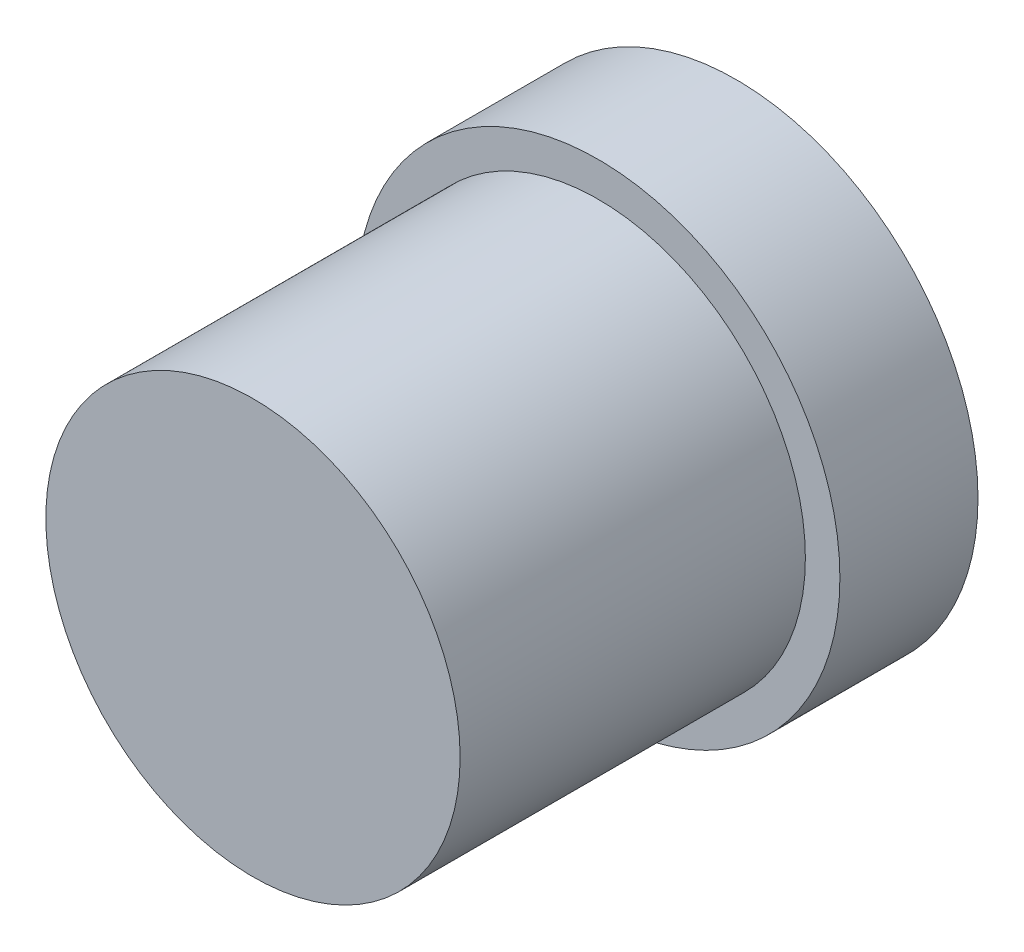
ISO-10303-21;
HEADER;
FILE_DESCRIPTION(('STEP AP214'),'2;1');
FILE_NAME('part.step','',(''),(''),'','','');
FILE_SCHEMA(('AUTOMOTIVE_DESIGN { 1 0 10303 214 1 1 1 1 }'));
ENDSEC;
DATA;
#1=APPLICATION_CONTEXT('core data for automotive mechanical design processes');
#2=APPLICATION_PROTOCOL_DEFINITION('international standard','automotive_design',2000,#1);
#3=PRODUCT_CONTEXT('',#1,'mechanical');
#4=PRODUCT('Part','Part','',(#3));
#5=PRODUCT_RELATED_PRODUCT_CATEGORY('part','',(#4));
#6=PRODUCT_DEFINITION_FORMATION('','',#4);
#7=PRODUCT_DEFINITION_CONTEXT('part definition',#1,'design');
#8=PRODUCT_DEFINITION('design','',#6,#7);
#9=PRODUCT_DEFINITION_SHAPE('','',#8);
#10=(LENGTH_UNIT() NAMED_UNIT(*) SI_UNIT(.MILLI.,.METRE.));
#11=(NAMED_UNIT(*) PLANE_ANGLE_UNIT() SI_UNIT($,.RADIAN.));
#12=(NAMED_UNIT(*) SI_UNIT($,.STERADIAN.) SOLID_ANGLE_UNIT());
#13=UNCERTAINTY_MEASURE_WITH_UNIT(LENGTH_MEASURE(1.E-05),#10,'distance_accuracy_value','');
#14=(GEOMETRIC_REPRESENTATION_CONTEXT(3) GLOBAL_UNCERTAINTY_ASSIGNED_CONTEXT((#13)) GLOBAL_UNIT_ASSIGNED_CONTEXT((#10,
#11,#12)) REPRESENTATION_CONTEXT('',''));
#15=CARTESIAN_POINT('',(0.,0.,0.));
#16=DIRECTION('',(0.,0.,1.));
#17=DIRECTION('',(1.,0.,0.));
#18=AXIS2_PLACEMENT_3D('',#15,#16,#17);
#19=CARTESIAN_POINT('',(0.,0.,4.));
#20=DIRECTION('',(0.,0.,-1.));
#21=DIRECTION('',(-1.,0.,0.));
#22=AXIS2_PLACEMENT_3D('',#19,#20,#21);
#23=CYLINDRICAL_SURFACE('',#22,7.);
#24=CARTESIAN_POINT('',(0.,0.,4.));
#25=DIRECTION('',(0.,0.,1.));
#26=DIRECTION('',(1.,0.,0.));
#27=AXIS2_PLACEMENT_3D('',#24,#25,#26);
#28=CIRCLE('',#27,7.);
#29=CARTESIAN_POINT('',(7.,0.,4.));
#30=VERTEX_POINT('',#29);
#31=EDGE_CURVE('E49',#30,#30,#28,.T.);
#32=ORIENTED_EDGE('',*,*,#31,.F.);
#33=EDGE_LOOP('',(#32));
#34=FACE_BOUND('',#33,.T.);
#35=CARTESIAN_POINT('',(0.,0.,0.));
#36=DIRECTION('',(0.,0.,1.));
#37=DIRECTION('',(1.,0.,0.));
#38=AXIS2_PLACEMENT_3D('',#35,#36,#37);
#39=CIRCLE('',#38,7.);
#40=CARTESIAN_POINT('',(7.,0.,0.));
#41=VERTEX_POINT('',#40);
#42=EDGE_CURVE('E44',#41,#41,#39,.T.);
#43=ORIENTED_EDGE('',*,*,#42,.T.);
#44=EDGE_LOOP('',(#43));
#45=FACE_BOUND('',#44,.T.);
#46=ADVANCED_FACE('F41',(#34,#45),#23,.T.);
#47=CARTESIAN_POINT('',(0.,0.,4.));
#48=DIRECTION('',(0.,0.,1.));
#49=DIRECTION('',(1.,0.,0.));
#50=AXIS2_PLACEMENT_3D('',#47,#48,#49);
#51=PLANE('',#50);
#52=CARTESIAN_POINT('',(0.,0.,4.));
#53=DIRECTION('',(0.,0.,1.));
#54=DIRECTION('',(1.,0.,0.));
#55=AXIS2_PLACEMENT_3D('',#52,#53,#54);
#56=CIRCLE('',#55,6.);
#57=CARTESIAN_POINT('',(6.,0.,4.));
#58=VERTEX_POINT('',#57);
#59=EDGE_CURVE('E10',#58,#58,#56,.T.);
#60=ORIENTED_EDGE('',*,*,#59,.F.);
#61=EDGE_LOOP('',(#60));
#62=FACE_BOUND('',#61,.T.);
#63=ORIENTED_EDGE('',*,*,#31,.T.);
#64=EDGE_LOOP('',(#63));
#65=FACE_BOUND('',#64,.T.);
#66=ADVANCED_FACE('F69',(#62,#65),#51,.T.);
#67=CARTESIAN_POINT('',(0.,0.,0.));
#68=DIRECTION('',(0.,0.,1.));
#69=DIRECTION('',(1.,0.,0.));
#70=AXIS2_PLACEMENT_3D('',#67,#68,#69);
#71=PLANE('',#70);
#72=ORIENTED_EDGE('',*,*,#42,.F.);
#73=EDGE_LOOP('',(#72));
#74=FACE_BOUND('',#73,.T.);
#75=ADVANCED_FACE('F66',(#74),#71,.F.);
#76=CARTESIAN_POINT('',(0.,0.,14.));
#77=DIRECTION('',(0.,0.,-1.));
#78=DIRECTION('',(-1.,0.,0.));
#79=AXIS2_PLACEMENT_3D('',#76,#77,#78);
#80=CYLINDRICAL_SURFACE('',#79,6.);
#81=CARTESIAN_POINT('',(0.,0.,14.));
#82=DIRECTION('',(0.,0.,1.));
#83=DIRECTION('',(1.,0.,0.));
#84=AXIS2_PLACEMENT_3D('',#81,#82,#83);
#85=CIRCLE('',#84,6.);
#86=CARTESIAN_POINT('',(6.,0.,14.));
#87=VERTEX_POINT('',#86);
#88=EDGE_CURVE('E56',#87,#87,#85,.T.);
#89=ORIENTED_EDGE('',*,*,#88,.F.);
#90=EDGE_LOOP('',(#89));
#91=FACE_BOUND('',#90,.T.);
#92=ORIENTED_EDGE('',*,*,#59,.T.);
#93=EDGE_LOOP('',(#92));
#94=FACE_BOUND('',#93,.T.);
#95=ADVANCED_FACE('F68',(#91,#94),#80,.T.);
#96=CARTESIAN_POINT('',(0.,0.,14.));
#97=DIRECTION('',(0.,0.,1.));
#98=DIRECTION('',(1.,0.,0.));
#99=AXIS2_PLACEMENT_3D('',#96,#97,#98);
#100=PLANE('',#99);
#101=ORIENTED_EDGE('',*,*,#88,.T.);
#102=EDGE_LOOP('',(#101));
#103=FACE_BOUND('',#102,.T.);
#104=ADVANCED_FACE('F74',(#103),#100,.T.);
#105=CLOSED_SHELL('',(#46,#66,#75,#95,#104));
#106=MANIFOLD_SOLID_BREP('B2',#105);
#107=ADVANCED_BREP_SHAPE_REPRESENTATION('',(#18,#106),#14);
#108=SHAPE_DEFINITION_REPRESENTATION(#9,#107);
ENDSEC;
END-ISO-10303-21;
